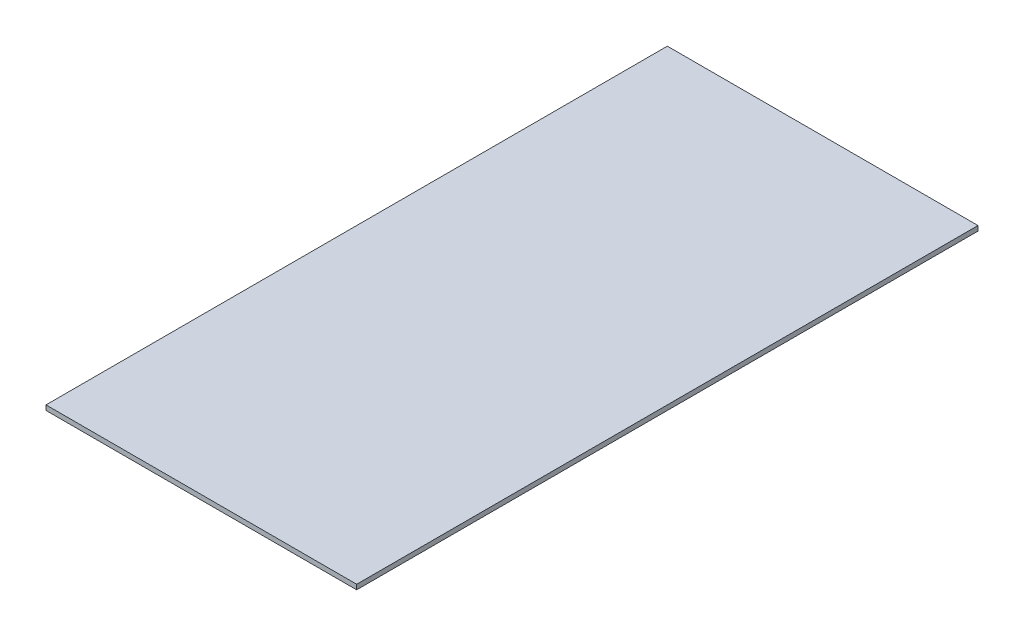
ISO-10303-21;
HEADER;
FILE_DESCRIPTION(('STEP AP214'),'2;1');
FILE_NAME('part.step','',(''),(''),'','','');
FILE_SCHEMA(('AUTOMOTIVE_DESIGN { 1 0 10303 214 1 1 1 1 }'));
ENDSEC;
DATA;
#1=APPLICATION_CONTEXT('core data for automotive mechanical design processes');
#2=APPLICATION_PROTOCOL_DEFINITION('international standard','automotive_design',2000,#1);
#3=PRODUCT_CONTEXT('',#1,'mechanical');
#4=PRODUCT('Part','Part','',(#3));
#5=PRODUCT_RELATED_PRODUCT_CATEGORY('part','',(#4));
#6=PRODUCT_DEFINITION_FORMATION('','',#4);
#7=PRODUCT_DEFINITION_CONTEXT('part definition',#1,'design');
#8=PRODUCT_DEFINITION('design','',#6,#7);
#9=PRODUCT_DEFINITION_SHAPE('','',#8);
#10=(LENGTH_UNIT() NAMED_UNIT(*) SI_UNIT(.MILLI.,.METRE.));
#11=(NAMED_UNIT(*) PLANE_ANGLE_UNIT() SI_UNIT($,.RADIAN.));
#12=(NAMED_UNIT(*) SI_UNIT($,.STERADIAN.) SOLID_ANGLE_UNIT());
#13=UNCERTAINTY_MEASURE_WITH_UNIT(LENGTH_MEASURE(1.E-05),#10,'distance_accuracy_value','');
#14=(GEOMETRIC_REPRESENTATION_CONTEXT(3) GLOBAL_UNCERTAINTY_ASSIGNED_CONTEXT((#13)) GLOBAL_UNIT_ASSIGNED_CONTEXT((#10,
#11,#12)) REPRESENTATION_CONTEXT('',''));
#15=CARTESIAN_POINT('',(0.,0.,0.));
#16=DIRECTION('',(0.,0.,1.));
#17=DIRECTION('',(1.,0.,0.));
#18=AXIS2_PLACEMENT_3D('',#15,#16,#17);
#19=CARTESIAN_POINT('',(0.,3.175,0.));
#20=DIRECTION('',(-1.,0.,0.));
#21=DIRECTION('',(0.,0.,1.));
#22=AXIS2_PLACEMENT_3D('',#19,#20,#21);
#23=PLANE('',#22);
#24=DIRECTION('',(0.,0.,-1.));
#25=VECTOR('',#24,1.);
#26=CARTESIAN_POINT('',(0.,0.,0.));
#27=LINE('',#26,#25);
#28=CARTESIAN_POINT('',(0.,0.,406.4));
#29=VERTEX_POINT('',#28);
#30=CARTESIAN_POINT('',(0.,0.,0.));
#31=VERTEX_POINT('',#30);
#32=EDGE_CURVE('E95',#29,#31,#27,.T.);
#33=ORIENTED_EDGE('',*,*,#32,.T.);
#34=DIRECTION('',(0.,-1.,0.));
#35=VECTOR('',#34,1.);
#36=CARTESIAN_POINT('',(0.,3.175,0.));
#37=LINE('',#36,#35);
#38=CARTESIAN_POINT('',(0.,3.175,0.));
#39=VERTEX_POINT('',#38);
#40=EDGE_CURVE('E11',#39,#31,#37,.T.);
#41=ORIENTED_EDGE('',*,*,#40,.F.);
#42=DIRECTION('',(0.,0.,-1.));
#43=VECTOR('',#42,1.);
#44=CARTESIAN_POINT('',(0.,3.175,0.));
#45=LINE('',#44,#43);
#46=CARTESIAN_POINT('',(0.,3.175,406.4));
#47=VERTEX_POINT('',#46);
#48=EDGE_CURVE('E83',#47,#39,#45,.T.);
#49=ORIENTED_EDGE('',*,*,#48,.F.);
#50=DIRECTION('',(0.,-1.,0.));
#51=VECTOR('',#50,1.);
#52=CARTESIAN_POINT('',(0.,3.175,406.4));
#53=LINE('',#52,#51);
#54=EDGE_CURVE('E91',#47,#29,#53,.T.);
#55=ORIENTED_EDGE('',*,*,#54,.T.);
#56=EDGE_LOOP('',(#33,#41,#49,#55));
#57=FACE_BOUND('',#56,.T.);
#58=ADVANCED_FACE('F32',(#57),#23,.F.);
#59=CARTESIAN_POINT('',(0.,3.175,0.));
#60=DIRECTION('',(0.,0.,1.));
#61=DIRECTION('',(1.,0.,0.));
#62=AXIS2_PLACEMENT_3D('',#59,#60,#61);
#63=PLANE('',#62);
#64=DIRECTION('',(-1.,0.,0.));
#65=VECTOR('',#64,1.);
#66=CARTESIAN_POINT('',(0.,0.,0.));
#67=LINE('',#66,#65);
#68=CARTESIAN_POINT('',(-203.2,0.,0.));
#69=VERTEX_POINT('',#68);
#70=EDGE_CURVE('E87',#31,#69,#67,.T.);
#71=ORIENTED_EDGE('',*,*,#70,.T.);
#72=DIRECTION('',(0.,-1.,0.));
#73=VECTOR('',#72,1.);
#74=CARTESIAN_POINT('',(-203.2,3.175,0.));
#75=LINE('',#74,#73);
#76=CARTESIAN_POINT('',(-203.2,3.175,0.));
#77=VERTEX_POINT('',#76);
#78=EDGE_CURVE('E40',#77,#69,#75,.T.);
#79=ORIENTED_EDGE('',*,*,#78,.F.);
#80=DIRECTION('',(-1.,0.,0.));
#81=VECTOR('',#80,1.);
#82=CARTESIAN_POINT('',(0.,3.175,0.));
#83=LINE('',#82,#81);
#84=EDGE_CURVE('E78',#39,#77,#83,.T.);
#85=ORIENTED_EDGE('',*,*,#84,.F.);
#86=ORIENTED_EDGE('',*,*,#40,.T.);
#87=EDGE_LOOP('',(#71,#79,#85,#86));
#88=FACE_BOUND('',#87,.T.);
#89=ADVANCED_FACE('F86',(#88),#63,.F.);
#90=CARTESIAN_POINT('',(-203.2,3.175,0.));
#91=DIRECTION('',(1.,0.,0.));
#92=DIRECTION('',(0.,0.,-1.));
#93=AXIS2_PLACEMENT_3D('',#90,#91,#92);
#94=PLANE('',#93);
#95=DIRECTION('',(0.,0.,1.));
#96=VECTOR('',#95,1.);
#97=CARTESIAN_POINT('',(-203.2,0.,0.));
#98=LINE('',#97,#96);
#99=CARTESIAN_POINT('',(-203.2,0.,406.4));
#100=VERTEX_POINT('',#99);
#101=EDGE_CURVE('E65',#69,#100,#98,.T.);
#102=ORIENTED_EDGE('',*,*,#101,.T.);
#103=DIRECTION('',(0.,-1.,0.));
#104=VECTOR('',#103,1.);
#105=CARTESIAN_POINT('',(-203.2,3.175,406.4));
#106=LINE('',#105,#104);
#107=CARTESIAN_POINT('',(-203.2,3.175,406.4));
#108=VERTEX_POINT('',#107);
#109=EDGE_CURVE('E88',#108,#100,#106,.T.);
#110=ORIENTED_EDGE('',*,*,#109,.F.);
#111=DIRECTION('',(0.,0.,1.));
#112=VECTOR('',#111,1.);
#113=CARTESIAN_POINT('',(-203.2,3.175,0.));
#114=LINE('',#113,#112);
#115=EDGE_CURVE('E81',#77,#108,#114,.T.);
#116=ORIENTED_EDGE('',*,*,#115,.F.);
#117=ORIENTED_EDGE('',*,*,#78,.T.);
#118=EDGE_LOOP('',(#102,#110,#116,#117));
#119=FACE_BOUND('',#118,.T.);
#120=ADVANCED_FACE('F89',(#119),#94,.F.);
#121=CARTESIAN_POINT('',(0.,3.175,406.4));
#122=DIRECTION('',(0.,0.,-1.));
#123=DIRECTION('',(-1.,0.,0.));
#124=AXIS2_PLACEMENT_3D('',#121,#122,#123);
#125=PLANE('',#124);
#126=DIRECTION('',(1.,0.,0.));
#127=VECTOR('',#126,1.);
#128=CARTESIAN_POINT('',(0.,0.,406.4));
#129=LINE('',#128,#127);
#130=EDGE_CURVE('E71',#100,#29,#129,.T.);
#131=ORIENTED_EDGE('',*,*,#130,.T.);
#132=ORIENTED_EDGE('',*,*,#54,.F.);
#133=DIRECTION('',(1.,0.,0.));
#134=VECTOR('',#133,1.);
#135=CARTESIAN_POINT('',(0.,3.175,406.4));
#136=LINE('',#135,#134);
#137=EDGE_CURVE('E48',#108,#47,#136,.T.);
#138=ORIENTED_EDGE('',*,*,#137,.F.);
#139=ORIENTED_EDGE('',*,*,#109,.T.);
#140=EDGE_LOOP('',(#131,#132,#138,#139));
#141=FACE_BOUND('',#140,.T.);
#142=ADVANCED_FACE('F102',(#141),#125,.F.);
#143=CARTESIAN_POINT('',(0.,3.175,0.));
#144=DIRECTION('',(0.,-1.,0.));
#145=DIRECTION('',(0.,0.,-1.));
#146=AXIS2_PLACEMENT_3D('',#143,#144,#145);
#147=PLANE('',#146);
#148=ORIENTED_EDGE('',*,*,#48,.T.);
#149=ORIENTED_EDGE('',*,*,#84,.T.);
#150=ORIENTED_EDGE('',*,*,#115,.T.);
#151=ORIENTED_EDGE('',*,*,#137,.T.);
#152=EDGE_LOOP('',(#148,#149,#150,#151));
#153=FACE_BOUND('',#152,.T.);
#154=ADVANCED_FACE('F79',(#153),#147,.F.);
#155=CARTESIAN_POINT('',(0.,0.,0.));
#156=DIRECTION('',(0.,-1.,0.));
#157=DIRECTION('',(0.,0.,-1.));
#158=AXIS2_PLACEMENT_3D('',#155,#156,#157);
#159=PLANE('',#158);
#160=ORIENTED_EDGE('',*,*,#32,.F.);
#161=ORIENTED_EDGE('',*,*,#130,.F.);
#162=ORIENTED_EDGE('',*,*,#101,.F.);
#163=ORIENTED_EDGE('',*,*,#70,.F.);
#164=EDGE_LOOP('',(#160,#161,#162,#163));
#165=FACE_BOUND('',#164,.T.);
#166=ADVANCED_FACE('F105',(#165),#159,.T.);
#167=CLOSED_SHELL('',(#58,#89,#120,#142,#154,#166));
#168=MANIFOLD_SOLID_BREP('B2',#167);
#169=ADVANCED_BREP_SHAPE_REPRESENTATION('',(#18,#168),#14);
#170=SHAPE_DEFINITION_REPRESENTATION(#9,#169);
ENDSEC;
END-ISO-10303-21;
